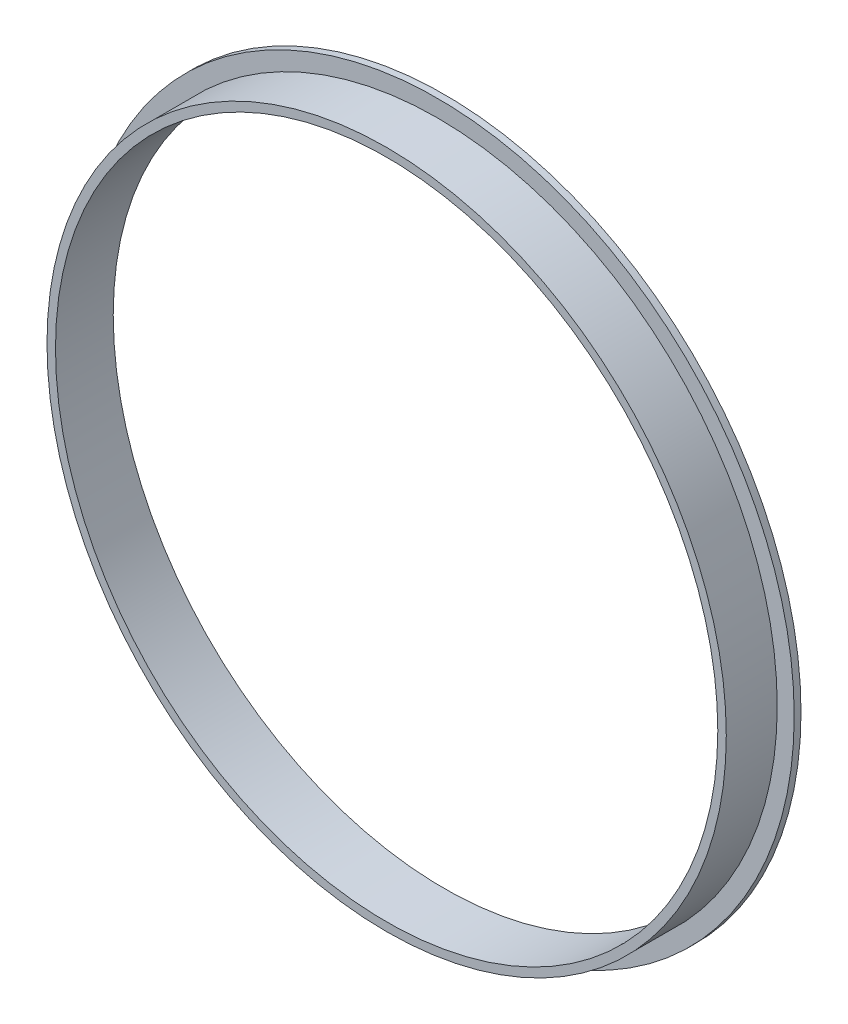
ISO-10303-21;
HEADER;
FILE_DESCRIPTION(('STEP AP214'),'2;1');
FILE_NAME('part.step','',(''),(''),'','','');
FILE_SCHEMA(('AUTOMOTIVE_DESIGN { 1 0 10303 214 1 1 1 1 }'));
ENDSEC;
DATA;
#1=APPLICATION_CONTEXT('core data for automotive mechanical design processes');
#2=APPLICATION_PROTOCOL_DEFINITION('international standard','automotive_design',2000,#1);
#3=PRODUCT_CONTEXT('',#1,'mechanical');
#4=PRODUCT('Part','Part','',(#3));
#5=PRODUCT_RELATED_PRODUCT_CATEGORY('part','',(#4));
#6=PRODUCT_DEFINITION_FORMATION('','',#4);
#7=PRODUCT_DEFINITION_CONTEXT('part definition',#1,'design');
#8=PRODUCT_DEFINITION('design','',#6,#7);
#9=PRODUCT_DEFINITION_SHAPE('','',#8);
#10=(LENGTH_UNIT() NAMED_UNIT(*) SI_UNIT(.MILLI.,.METRE.));
#11=(NAMED_UNIT(*) PLANE_ANGLE_UNIT() SI_UNIT($,.RADIAN.));
#12=(NAMED_UNIT(*) SI_UNIT($,.STERADIAN.) SOLID_ANGLE_UNIT());
#13=UNCERTAINTY_MEASURE_WITH_UNIT(LENGTH_MEASURE(1.E-05),#10,'distance_accuracy_value','');
#14=(GEOMETRIC_REPRESENTATION_CONTEXT(3) GLOBAL_UNCERTAINTY_ASSIGNED_CONTEXT((#13)) GLOBAL_UNIT_ASSIGNED_CONTEXT((#10,
#11,#12)) REPRESENTATION_CONTEXT('',''));
#15=CARTESIAN_POINT('',(0.,0.,0.));
#16=DIRECTION('',(0.,0.,1.));
#17=DIRECTION('',(1.,0.,0.));
#18=AXIS2_PLACEMENT_3D('',#15,#16,#17);
#19=CARTESIAN_POINT('',(0.,0.,0.4));
#20=DIRECTION('',(0.,0.,1.));
#21=DIRECTION('',(1.,0.,0.));
#22=AXIS2_PLACEMENT_3D('',#19,#20,#21);
#23=PLANE('',#22);
#24=CARTESIAN_POINT('',(0.,0.,0.4));
#25=DIRECTION('',(0.,0.,1.));
#26=DIRECTION('',(1.,0.,0.));
#27=AXIS2_PLACEMENT_3D('',#24,#25,#26);
#28=CIRCLE('',#27,21.);
#29=CARTESIAN_POINT('',(21.,0.,0.4));
#30=VERTEX_POINT('',#29);
#31=EDGE_CURVE('E10',#30,#30,#28,.T.);
#32=ORIENTED_EDGE('',*,*,#31,.T.);
#33=EDGE_LOOP('',(#32));
#34=FACE_BOUND('',#33,.T.);
#35=CARTESIAN_POINT('',(0.,0.,0.4));
#36=DIRECTION('',(0.,0.,1.));
#37=DIRECTION('',(1.,0.,0.));
#38=AXIS2_PLACEMENT_3D('',#35,#36,#37);
#39=CIRCLE('',#38,20.);
#40=CARTESIAN_POINT('',(20.,0.,0.4));
#41=VERTEX_POINT('',#40);
#42=EDGE_CURVE('E43',#41,#41,#39,.T.);
#43=ORIENTED_EDGE('',*,*,#42,.F.);
#44=EDGE_LOOP('',(#43));
#45=FACE_BOUND('',#44,.T.);
#46=ADVANCED_FACE('F30',(#34,#45),#23,.T.);
#47=CARTESIAN_POINT('',(0.,0.,0.4));
#48=DIRECTION('',(0.,0.,-1.));
#49=DIRECTION('',(-1.,0.,0.));
#50=AXIS2_PLACEMENT_3D('',#47,#48,#49);
#51=CYLINDRICAL_SURFACE('',#50,21.);
#52=ORIENTED_EDGE('',*,*,#31,.F.);
#53=EDGE_LOOP('',(#52));
#54=FACE_BOUND('',#53,.T.);
#55=CARTESIAN_POINT('',(0.,0.,0.));
#56=DIRECTION('',(0.,0.,1.));
#57=DIRECTION('',(1.,0.,0.));
#58=AXIS2_PLACEMENT_3D('',#55,#56,#57);
#59=CIRCLE('',#58,21.);
#60=CARTESIAN_POINT('',(21.,0.,0.));
#61=VERTEX_POINT('',#60);
#62=EDGE_CURVE('E34',#61,#61,#59,.T.);
#63=ORIENTED_EDGE('',*,*,#62,.T.);
#64=EDGE_LOOP('',(#63));
#65=FACE_BOUND('',#64,.T.);
#66=ADVANCED_FACE('F32',(#54,#65),#51,.T.);
#67=CARTESIAN_POINT('',(0.,0.,0.));
#68=DIRECTION('',(0.,0.,1.));
#69=DIRECTION('',(1.,0.,0.));
#70=AXIS2_PLACEMENT_3D('',#67,#68,#69);
#71=PLANE('',#70);
#72=CARTESIAN_POINT('',(0.,0.,0.));
#73=DIRECTION('',(0.,0.,1.));
#74=DIRECTION('',(1.,0.,0.));
#75=AXIS2_PLACEMENT_3D('',#72,#73,#74);
#76=CIRCLE('',#75,19.5);
#77=CARTESIAN_POINT('',(19.5,0.,0.));
#78=VERTEX_POINT('',#77);
#79=EDGE_CURVE('E46',#78,#78,#76,.T.);
#80=ORIENTED_EDGE('',*,*,#79,.T.);
#81=EDGE_LOOP('',(#80));
#82=FACE_BOUND('',#81,.T.);
#83=ORIENTED_EDGE('',*,*,#62,.F.);
#84=EDGE_LOOP('',(#83));
#85=FACE_BOUND('',#84,.T.);
#86=ADVANCED_FACE('F55',(#82,#85),#71,.F.);
#87=CARTESIAN_POINT('',(0.,0.,3.4));
#88=DIRECTION('',(0.,0.,-1.));
#89=DIRECTION('',(-1.,0.,0.));
#90=AXIS2_PLACEMENT_3D('',#87,#88,#89);
#91=CYLINDRICAL_SURFACE('',#90,20.);
#92=CARTESIAN_POINT('',(0.,0.,3.4));
#93=DIRECTION('',(0.,0.,1.));
#94=DIRECTION('',(1.,0.,0.));
#95=AXIS2_PLACEMENT_3D('',#92,#93,#94);
#96=CIRCLE('',#95,20.);
#97=CARTESIAN_POINT('',(20.,0.,3.4));
#98=VERTEX_POINT('',#97);
#99=EDGE_CURVE('E41',#98,#98,#96,.T.);
#100=ORIENTED_EDGE('',*,*,#99,.F.);
#101=EDGE_LOOP('',(#100));
#102=FACE_BOUND('',#101,.T.);
#103=ORIENTED_EDGE('',*,*,#42,.T.);
#104=EDGE_LOOP('',(#103));
#105=FACE_BOUND('',#104,.T.);
#106=ADVANCED_FACE('F67',(#102,#105),#91,.T.);
#107=CARTESIAN_POINT('',(0.,0.,3.4));
#108=DIRECTION('',(0.,0.,1.));
#109=DIRECTION('',(1.,0.,0.));
#110=AXIS2_PLACEMENT_3D('',#107,#108,#109);
#111=PLANE('',#110);
#112=CARTESIAN_POINT('',(0.,0.,3.4));
#113=DIRECTION('',(0.,0.,1.));
#114=DIRECTION('',(1.,0.,0.));
#115=AXIS2_PLACEMENT_3D('',#112,#113,#114);
#116=CIRCLE('',#115,19.5);
#117=CARTESIAN_POINT('',(19.5,0.,3.4));
#118=VERTEX_POINT('',#117);
#119=EDGE_CURVE('E49',#118,#118,#116,.T.);
#120=ORIENTED_EDGE('',*,*,#119,.F.);
#121=EDGE_LOOP('',(#120));
#122=FACE_BOUND('',#121,.T.);
#123=ORIENTED_EDGE('',*,*,#99,.T.);
#124=EDGE_LOOP('',(#123));
#125=FACE_BOUND('',#124,.T.);
#126=ADVANCED_FACE('F61',(#122,#125),#111,.T.);
#127=CARTESIAN_POINT('',(0.,0.,0.));
#128=DIRECTION('',(0.,0.,1.));
#129=DIRECTION('',(1.,0.,0.));
#130=AXIS2_PLACEMENT_3D('',#127,#128,#129);
#131=CYLINDRICAL_SURFACE('',#130,19.5);
#132=ORIENTED_EDGE('',*,*,#79,.F.);
#133=EDGE_LOOP('',(#132));
#134=FACE_BOUND('',#133,.T.);
#135=ORIENTED_EDGE('',*,*,#119,.T.);
#136=EDGE_LOOP('',(#135));
#137=FACE_BOUND('',#136,.T.);
#138=ADVANCED_FACE('F58',(#134,#137),#131,.F.);
#139=CLOSED_SHELL('',(#46,#66,#86,#106,#126,#138));
#140=MANIFOLD_SOLID_BREP('B2',#139);
#141=ADVANCED_BREP_SHAPE_REPRESENTATION('',(#18,#140),#14);
#142=SHAPE_DEFINITION_REPRESENTATION(#9,#141);
ENDSEC;
END-ISO-10303-21;
